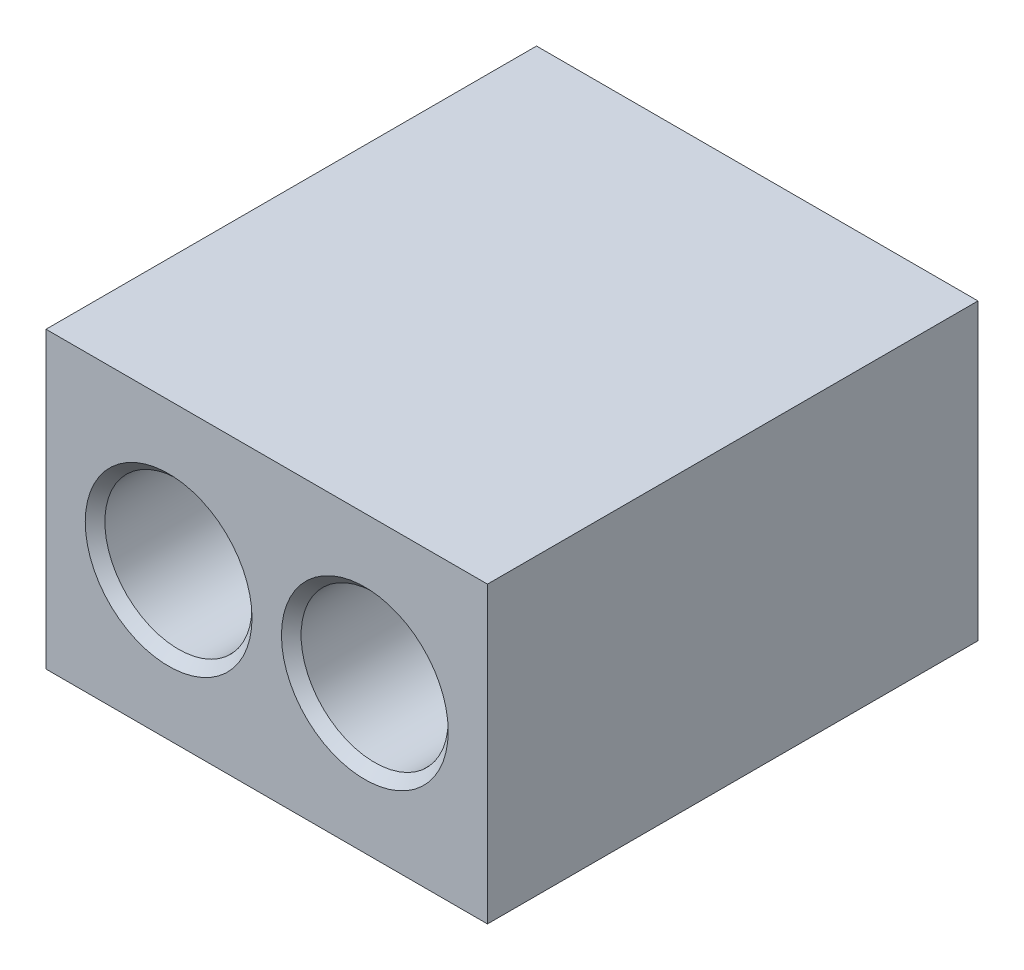
ISO-10303-21;
HEADER;
FILE_DESCRIPTION(('STEP AP214'),'2;1');
FILE_NAME('part.step','',(''),(''),'','','');
FILE_SCHEMA(('AUTOMOTIVE_DESIGN { 1 0 10303 214 1 1 1 1 }'));
ENDSEC;
DATA;
#1=APPLICATION_CONTEXT('core data for automotive mechanical design processes');
#2=APPLICATION_PROTOCOL_DEFINITION('international standard','automotive_design',2000,#1);
#3=PRODUCT_CONTEXT('',#1,'mechanical');
#4=PRODUCT('Part','Part','',(#3));
#5=PRODUCT_RELATED_PRODUCT_CATEGORY('part','',(#4));
#6=PRODUCT_DEFINITION_FORMATION('','',#4);
#7=PRODUCT_DEFINITION_CONTEXT('part definition',#1,'design');
#8=PRODUCT_DEFINITION('design','',#6,#7);
#9=PRODUCT_DEFINITION_SHAPE('','',#8);
#10=(LENGTH_UNIT() NAMED_UNIT(*) SI_UNIT(.MILLI.,.METRE.));
#11=(NAMED_UNIT(*) PLANE_ANGLE_UNIT() SI_UNIT($,.RADIAN.));
#12=(NAMED_UNIT(*) SI_UNIT($,.STERADIAN.) SOLID_ANGLE_UNIT());
#13=UNCERTAINTY_MEASURE_WITH_UNIT(LENGTH_MEASURE(1.E-05),#10,'distance_accuracy_value','');
#14=(GEOMETRIC_REPRESENTATION_CONTEXT(3) GLOBAL_UNCERTAINTY_ASSIGNED_CONTEXT((#13)) GLOBAL_UNIT_ASSIGNED_CONTEXT((#10,
#11,#12)) REPRESENTATION_CONTEXT('',''));
#15=CARTESIAN_POINT('',(0.,0.,0.));
#16=DIRECTION('',(0.,0.,1.));
#17=DIRECTION('',(1.,0.,0.));
#18=AXIS2_PLACEMENT_3D('',#15,#16,#17);
#19=CARTESIAN_POINT('',(0.,0.,25.));
#20=DIRECTION('',(0.,0.,1.));
#21=DIRECTION('',(1.,0.,0.));
#22=AXIS2_PLACEMENT_3D('',#19,#20,#21);
#23=PLANE('',#22);
#24=CARTESIAN_POINT('',(-10.,0.,25.));
#25=DIRECTION('',(0.,0.,1.));
#26=DIRECTION('',(1.,0.,0.));
#27=AXIS2_PLACEMENT_3D('',#24,#25,#26);
#28=CIRCLE('',#27,8.49999999999999);
#29=CARTESIAN_POINT('',(-1.50000000000001,0.,25.));
#30=VERTEX_POINT('',#29);
#31=EDGE_CURVE('E11',#30,#30,#28,.F.);
#32=ORIENTED_EDGE('',*,*,#31,.T.);
#33=EDGE_LOOP('',(#32));
#34=FACE_BOUND('',#33,.T.);
#35=CARTESIAN_POINT('',(10.,0.,25.));
#36=DIRECTION('',(0.,0.,1.));
#37=DIRECTION('',(1.,0.,0.));
#38=AXIS2_PLACEMENT_3D('',#35,#36,#37);
#39=CIRCLE('',#38,8.50000000000002);
#40=CARTESIAN_POINT('',(18.5,0.,25.));
#41=VERTEX_POINT('',#40);
#42=EDGE_CURVE('E49',#41,#41,#39,.F.);
#43=ORIENTED_EDGE('',*,*,#42,.T.);
#44=EDGE_LOOP('',(#43));
#45=FACE_BOUND('',#44,.T.);
#46=DIRECTION('',(0.,1.,0.));
#47=VECTOR('',#46,1.);
#48=CARTESIAN_POINT('',(22.5,15.,25.));
#49=LINE('',#48,#47);
#50=CARTESIAN_POINT('',(22.5,-15.,25.));
#51=VERTEX_POINT('',#50);
#52=CARTESIAN_POINT('',(22.5,15.,25.));
#53=VERTEX_POINT('',#52);
#54=EDGE_CURVE('E92',#51,#53,#49,.T.);
#55=ORIENTED_EDGE('',*,*,#54,.T.);
#56=DIRECTION('',(-1.,0.,0.));
#57=VECTOR('',#56,1.);
#58=CARTESIAN_POINT('',(-22.5,15.,25.));
#59=LINE('',#58,#57);
#60=CARTESIAN_POINT('',(-22.5,15.,25.));
#61=VERTEX_POINT('',#60);
#62=EDGE_CURVE('E88',#53,#61,#59,.T.);
#63=ORIENTED_EDGE('',*,*,#62,.T.);
#64=DIRECTION('',(0.,-1.,0.));
#65=VECTOR('',#64,1.);
#66=CARTESIAN_POINT('',(-22.5,15.,25.));
#67=LINE('',#66,#65);
#68=CARTESIAN_POINT('',(-22.5,-15.,25.));
#69=VERTEX_POINT('',#68);
#70=EDGE_CURVE('E90',#61,#69,#67,.T.);
#71=ORIENTED_EDGE('',*,*,#70,.T.);
#72=DIRECTION('',(1.,0.,0.));
#73=VECTOR('',#72,1.);
#74=CARTESIAN_POINT('',(-22.5,-15.,25.));
#75=LINE('',#74,#73);
#76=EDGE_CURVE('E57',#69,#51,#75,.T.);
#77=ORIENTED_EDGE('',*,*,#76,.T.);
#78=EDGE_LOOP('',(#55,#63,#71,#77));
#79=FACE_BOUND('',#78,.T.);
#80=ADVANCED_FACE('F39',(#34,#45,#79),#23,.T.);
#81=CARTESIAN_POINT('',(0.,0.,-25.));
#82=DIRECTION('',(0.,0.,1.));
#83=DIRECTION('',(1.,0.,0.));
#84=AXIS2_PLACEMENT_3D('',#81,#82,#83);
#85=PLANE('',#84);
#86=CARTESIAN_POINT('',(-10.,0.,-25.));
#87=DIRECTION('',(0.,0.,1.));
#88=DIRECTION('',(1.,0.,0.));
#89=AXIS2_PLACEMENT_3D('',#86,#87,#88);
#90=CIRCLE('',#89,8.50000000000001);
#91=CARTESIAN_POINT('',(-1.49999999999999,0.,-25.));
#92=VERTEX_POINT('',#91);
#93=EDGE_CURVE('E131',#92,#92,#90,.T.);
#94=ORIENTED_EDGE('',*,*,#93,.T.);
#95=EDGE_LOOP('',(#94));
#96=FACE_BOUND('',#95,.T.);
#97=CARTESIAN_POINT('',(10.,0.,-25.));
#98=DIRECTION('',(0.,0.,1.));
#99=DIRECTION('',(1.,0.,0.));
#100=AXIS2_PLACEMENT_3D('',#97,#98,#99);
#101=CIRCLE('',#100,8.49999999999999);
#102=CARTESIAN_POINT('',(18.5,0.,-25.));
#103=VERTEX_POINT('',#102);
#104=EDGE_CURVE('E127',#103,#103,#101,.T.);
#105=ORIENTED_EDGE('',*,*,#104,.T.);
#106=EDGE_LOOP('',(#105));
#107=FACE_BOUND('',#106,.T.);
#108=DIRECTION('',(0.,1.,0.));
#109=VECTOR('',#108,1.);
#110=CARTESIAN_POINT('',(22.5,15.,-25.));
#111=LINE('',#110,#109);
#112=CARTESIAN_POINT('',(22.5,-15.,-25.));
#113=VERTEX_POINT('',#112);
#114=CARTESIAN_POINT('',(22.5,15.,-25.));
#115=VERTEX_POINT('',#114);
#116=EDGE_CURVE('E111',#113,#115,#111,.T.);
#117=ORIENTED_EDGE('',*,*,#116,.F.);
#118=DIRECTION('',(1.,0.,0.));
#119=VECTOR('',#118,1.);
#120=CARTESIAN_POINT('',(-22.5,-15.,-25.));
#121=LINE('',#120,#119);
#122=CARTESIAN_POINT('',(-22.5,-15.,-25.));
#123=VERTEX_POINT('',#122);
#124=EDGE_CURVE('E80',#123,#113,#121,.T.);
#125=ORIENTED_EDGE('',*,*,#124,.F.);
#126=DIRECTION('',(0.,-1.,0.));
#127=VECTOR('',#126,1.);
#128=CARTESIAN_POINT('',(-22.5,15.,-25.));
#129=LINE('',#128,#127);
#130=CARTESIAN_POINT('',(-22.5,15.,-25.));
#131=VERTEX_POINT('',#130);
#132=EDGE_CURVE('E74',#131,#123,#129,.T.);
#133=ORIENTED_EDGE('',*,*,#132,.F.);
#134=DIRECTION('',(-1.,0.,0.));
#135=VECTOR('',#134,1.);
#136=CARTESIAN_POINT('',(-22.5,15.,-25.));
#137=LINE('',#136,#135);
#138=EDGE_CURVE('E98',#115,#131,#137,.T.);
#139=ORIENTED_EDGE('',*,*,#138,.F.);
#140=EDGE_LOOP('',(#117,#125,#133,#139));
#141=FACE_BOUND('',#140,.T.);
#142=ADVANCED_FACE('F177',(#96,#107,#141),#85,.F.);
#143=CARTESIAN_POINT('',(22.5,15.,25.));
#144=DIRECTION('',(-1.,0.,0.));
#145=DIRECTION('',(0.,-1.,0.));
#146=AXIS2_PLACEMENT_3D('',#143,#144,#145);
#147=PLANE('',#146);
#148=ORIENTED_EDGE('',*,*,#116,.T.);
#149=DIRECTION('',(0.,0.,-1.));
#150=VECTOR('',#149,1.);
#151=CARTESIAN_POINT('',(22.5,15.,25.));
#152=LINE('',#151,#150);
#153=EDGE_CURVE('E100',#53,#115,#152,.T.);
#154=ORIENTED_EDGE('',*,*,#153,.F.);
#155=ORIENTED_EDGE('',*,*,#54,.F.);
#156=DIRECTION('',(0.,0.,-1.));
#157=VECTOR('',#156,1.);
#158=CARTESIAN_POINT('',(22.5,-15.,25.));
#159=LINE('',#158,#157);
#160=EDGE_CURVE('E107',#51,#113,#159,.T.);
#161=ORIENTED_EDGE('',*,*,#160,.T.);
#162=EDGE_LOOP('',(#148,#154,#155,#161));
#163=FACE_BOUND('',#162,.T.);
#164=ADVANCED_FACE('F183',(#163),#147,.F.);
#165=CARTESIAN_POINT('',(-22.5,15.,25.));
#166=DIRECTION('',(0.,-1.,0.));
#167=DIRECTION('',(0.,0.,-1.));
#168=AXIS2_PLACEMENT_3D('',#165,#166,#167);
#169=PLANE('',#168);
#170=ORIENTED_EDGE('',*,*,#138,.T.);
#171=DIRECTION('',(0.,0.,-1.));
#172=VECTOR('',#171,1.);
#173=CARTESIAN_POINT('',(-22.5,15.,25.));
#174=LINE('',#173,#172);
#175=EDGE_CURVE('E96',#61,#131,#174,.T.);
#176=ORIENTED_EDGE('',*,*,#175,.F.);
#177=ORIENTED_EDGE('',*,*,#62,.F.);
#178=ORIENTED_EDGE('',*,*,#153,.T.);
#179=EDGE_LOOP('',(#170,#176,#177,#178));
#180=FACE_BOUND('',#179,.T.);
#181=ADVANCED_FACE('F97',(#180),#169,.F.);
#182=CARTESIAN_POINT('',(-22.5,15.,25.));
#183=DIRECTION('',(1.,0.,0.));
#184=DIRECTION('',(0.,1.,0.));
#185=AXIS2_PLACEMENT_3D('',#182,#183,#184);
#186=PLANE('',#185);
#187=ORIENTED_EDGE('',*,*,#132,.T.);
#188=DIRECTION('',(0.,0.,-1.));
#189=VECTOR('',#188,1.);
#190=CARTESIAN_POINT('',(-22.5,-15.,25.));
#191=LINE('',#190,#189);
#192=EDGE_CURVE('E101',#69,#123,#191,.T.);
#193=ORIENTED_EDGE('',*,*,#192,.F.);
#194=ORIENTED_EDGE('',*,*,#70,.F.);
#195=ORIENTED_EDGE('',*,*,#175,.T.);
#196=EDGE_LOOP('',(#187,#193,#194,#195));
#197=FACE_BOUND('',#196,.T.);
#198=ADVANCED_FACE('F103',(#197),#186,.F.);
#199=CARTESIAN_POINT('',(-22.5,-15.,25.));
#200=DIRECTION('',(0.,1.,0.));
#201=DIRECTION('',(0.,0.,1.));
#202=AXIS2_PLACEMENT_3D('',#199,#200,#201);
#203=PLANE('',#202);
#204=ORIENTED_EDGE('',*,*,#124,.T.);
#205=ORIENTED_EDGE('',*,*,#160,.F.);
#206=ORIENTED_EDGE('',*,*,#76,.F.);
#207=ORIENTED_EDGE('',*,*,#192,.T.);
#208=EDGE_LOOP('',(#204,#205,#206,#207));
#209=FACE_BOUND('',#208,.T.);
#210=ADVANCED_FACE('F173',(#209),#203,.F.);
#211=CARTESIAN_POINT('',(-10.,0.,25.));
#212=DIRECTION('',(0.,0.,-1.));
#213=DIRECTION('',(-1.,0.,0.));
#214=AXIS2_PLACEMENT_3D('',#211,#212,#213);
#215=CYLINDRICAL_SURFACE('',#214,7.5);
#216=CARTESIAN_POINT('',(-10.,0.,-24.));
#217=DIRECTION('',(0.,0.,1.));
#218=DIRECTION('',(1.,0.,0.));
#219=AXIS2_PLACEMENT_3D('',#216,#217,#218);
#220=CIRCLE('',#219,7.5);
#221=CARTESIAN_POINT('',(-2.5,0.,-24.));
#222=VERTEX_POINT('',#221);
#223=EDGE_CURVE('E139',#222,#222,#220,.F.);
#224=ORIENTED_EDGE('',*,*,#223,.T.);
#225=EDGE_LOOP('',(#224));
#226=FACE_BOUND('',#225,.T.);
#227=CARTESIAN_POINT('',(-10.,0.,24.));
#228=DIRECTION('',(0.,0.,1.));
#229=DIRECTION('',(1.,0.,0.));
#230=AXIS2_PLACEMENT_3D('',#227,#228,#229);
#231=CIRCLE('',#230,7.5);
#232=CARTESIAN_POINT('',(-2.5,0.,24.));
#233=VERTEX_POINT('',#232);
#234=EDGE_CURVE('E135',#233,#233,#231,.T.);
#235=ORIENTED_EDGE('',*,*,#234,.T.);
#236=EDGE_LOOP('',(#235));
#237=FACE_BOUND('',#236,.T.);
#238=ADVANCED_FACE('F163',(#226,#237),#215,.F.);
#239=CARTESIAN_POINT('',(10.,0.,25.));
#240=DIRECTION('',(0.,0.,-1.));
#241=DIRECTION('',(-1.,0.,0.));
#242=AXIS2_PLACEMENT_3D('',#239,#240,#241);
#243=CYLINDRICAL_SURFACE('',#242,7.5);
#244=CARTESIAN_POINT('',(10.,0.,-24.));
#245=DIRECTION('',(0.,0.,1.));
#246=DIRECTION('',(1.,0.,0.));
#247=AXIS2_PLACEMENT_3D('',#244,#245,#246);
#248=CIRCLE('',#247,7.5);
#249=CARTESIAN_POINT('',(17.5,0.,-24.));
#250=VERTEX_POINT('',#249);
#251=EDGE_CURVE('E147',#250,#250,#248,.F.);
#252=ORIENTED_EDGE('',*,*,#251,.T.);
#253=EDGE_LOOP('',(#252));
#254=FACE_BOUND('',#253,.T.);
#255=CARTESIAN_POINT('',(10.,0.,24.));
#256=DIRECTION('',(0.,0.,1.));
#257=DIRECTION('',(1.,0.,0.));
#258=AXIS2_PLACEMENT_3D('',#255,#256,#257);
#259=CIRCLE('',#258,7.5);
#260=CARTESIAN_POINT('',(17.5,0.,24.));
#261=VERTEX_POINT('',#260);
#262=EDGE_CURVE('E143',#261,#261,#259,.T.);
#263=ORIENTED_EDGE('',*,*,#262,.T.);
#264=EDGE_LOOP('',(#263));
#265=FACE_BOUND('',#264,.T.);
#266=ADVANCED_FACE('F160',(#254,#265),#243,.F.);
#267=CARTESIAN_POINT('',(-10.,0.,-25.));
#268=DIRECTION('',(0.,0.,-1.));
#269=DIRECTION('',(-1.,0.,0.));
#270=AXIS2_PLACEMENT_3D('',#267,#268,#269);
#271=CONICAL_SURFACE('',#270,8.50000000000001,0.785398163397449);
#272=ORIENTED_EDGE('',*,*,#223,.F.);
#273=EDGE_LOOP('',(#272));
#274=FACE_BOUND('',#273,.T.);
#275=ORIENTED_EDGE('',*,*,#93,.F.);
#276=EDGE_LOOP('',(#275));
#277=FACE_BOUND('',#276,.T.);
#278=ADVANCED_FACE('F162',(#274,#277),#271,.F.);
#279=CARTESIAN_POINT('',(10.,0.,-25.));
#280=DIRECTION('',(0.,0.,-1.));
#281=DIRECTION('',(-1.,0.,0.));
#282=AXIS2_PLACEMENT_3D('',#279,#280,#281);
#283=CONICAL_SURFACE('',#282,8.49999999999999,0.785398163397448);
#284=ORIENTED_EDGE('',*,*,#251,.F.);
#285=EDGE_LOOP('',(#284));
#286=FACE_BOUND('',#285,.T.);
#287=ORIENTED_EDGE('',*,*,#104,.F.);
#288=EDGE_LOOP('',(#287));
#289=FACE_BOUND('',#288,.T.);
#290=ADVANCED_FACE('F170',(#286,#289),#283,.F.);
#291=CARTESIAN_POINT('',(-10.,0.,24.));
#292=DIRECTION('',(0.,0.,1.));
#293=DIRECTION('',(1.,0.,0.));
#294=AXIS2_PLACEMENT_3D('',#291,#292,#293);
#295=CONICAL_SURFACE('',#294,7.5,0.785398163397449);
#296=ORIENTED_EDGE('',*,*,#31,.F.);
#297=EDGE_LOOP('',(#296));
#298=FACE_BOUND('',#297,.T.);
#299=ORIENTED_EDGE('',*,*,#234,.F.);
#300=EDGE_LOOP('',(#299));
#301=FACE_BOUND('',#300,.T.);
#302=ADVANCED_FACE('F157',(#298,#301),#295,.F.);
#303=CARTESIAN_POINT('',(10.,0.,24.));
#304=DIRECTION('',(0.,0.,1.));
#305=DIRECTION('',(1.,0.,0.));
#306=AXIS2_PLACEMENT_3D('',#303,#304,#305);
#307=CONICAL_SURFACE('',#306,7.5,0.785398163397451);
#308=ORIENTED_EDGE('',*,*,#42,.F.);
#309=EDGE_LOOP('',(#308));
#310=FACE_BOUND('',#309,.T.);
#311=ORIENTED_EDGE('',*,*,#262,.F.);
#312=EDGE_LOOP('',(#311));
#313=FACE_BOUND('',#312,.T.);
#314=ADVANCED_FACE('F41',(#310,#313),#307,.F.);
#315=CLOSED_SHELL('',(#80,#142,#164,#181,#198,#210,#238,#266,#278,#290,#302,#314));
#316=MANIFOLD_SOLID_BREP('B2',#315);
#317=ADVANCED_BREP_SHAPE_REPRESENTATION('',(#18,#316),#14);
#318=SHAPE_DEFINITION_REPRESENTATION(#9,#317);
ENDSEC;
END-ISO-10303-21;
